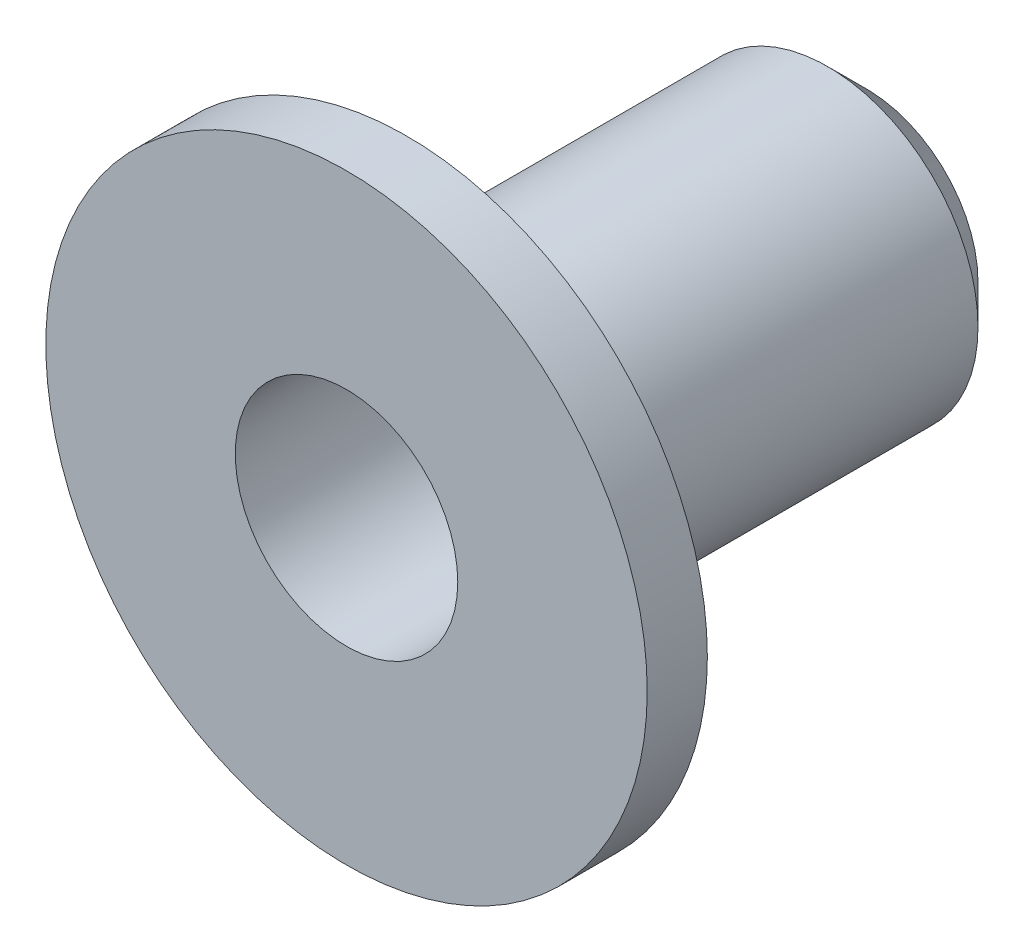
ISO-10303-21;
HEADER;
FILE_DESCRIPTION(('STEP AP214'),'2;1');
FILE_NAME('part.step','',(''),(''),'','','');
FILE_SCHEMA(('AUTOMOTIVE_DESIGN { 1 0 10303 214 1 1 1 1 }'));
ENDSEC;
DATA;
#1=APPLICATION_CONTEXT('core data for automotive mechanical design processes');
#2=APPLICATION_PROTOCOL_DEFINITION('international standard','automotive_design',2000,#1);
#3=PRODUCT_CONTEXT('',#1,'mechanical');
#4=PRODUCT('Part','Part','',(#3));
#5=PRODUCT_RELATED_PRODUCT_CATEGORY('part','',(#4));
#6=PRODUCT_DEFINITION_FORMATION('','',#4);
#7=PRODUCT_DEFINITION_CONTEXT('part definition',#1,'design');
#8=PRODUCT_DEFINITION('design','',#6,#7);
#9=PRODUCT_DEFINITION_SHAPE('','',#8);
#10=(LENGTH_UNIT() NAMED_UNIT(*) SI_UNIT(.MILLI.,.METRE.));
#11=(NAMED_UNIT(*) PLANE_ANGLE_UNIT() SI_UNIT($,.RADIAN.));
#12=(NAMED_UNIT(*) SI_UNIT($,.STERADIAN.) SOLID_ANGLE_UNIT());
#13=UNCERTAINTY_MEASURE_WITH_UNIT(LENGTH_MEASURE(1.E-05),#10,'distance_accuracy_value','');
#14=(GEOMETRIC_REPRESENTATION_CONTEXT(3) GLOBAL_UNCERTAINTY_ASSIGNED_CONTEXT((#13)) GLOBAL_UNIT_ASSIGNED_CONTEXT((#10,
#11,#12)) REPRESENTATION_CONTEXT('',''));
#15=CARTESIAN_POINT('',(0.,0.,0.));
#16=DIRECTION('',(0.,0.,1.));
#17=DIRECTION('',(1.,0.,0.));
#18=AXIS2_PLACEMENT_3D('',#15,#16,#17);
#19=CARTESIAN_POINT('',(0.,0.,3.));
#20=DIRECTION('',(0.,0.,-1.));
#21=DIRECTION('',(-1.,0.,0.));
#22=AXIS2_PLACEMENT_3D('',#19,#20,#21);
#23=CYLINDRICAL_SURFACE('',#22,15.);
#24=CARTESIAN_POINT('',(0.,0.,3.));
#25=DIRECTION('',(0.,0.,1.));
#26=DIRECTION('',(1.,0.,0.));
#27=AXIS2_PLACEMENT_3D('',#24,#25,#26);
#28=CIRCLE('',#27,15.);
#29=CARTESIAN_POINT('',(15.,0.,3.));
#30=VERTEX_POINT('',#29);
#31=EDGE_CURVE('E51',#30,#30,#28,.T.);
#32=ORIENTED_EDGE('',*,*,#31,.F.);
#33=EDGE_LOOP('',(#32));
#34=FACE_BOUND('',#33,.T.);
#35=CARTESIAN_POINT('',(0.,0.,0.));
#36=DIRECTION('',(0.,0.,1.));
#37=DIRECTION('',(1.,0.,0.));
#38=AXIS2_PLACEMENT_3D('',#35,#36,#37);
#39=CIRCLE('',#38,15.);
#40=CARTESIAN_POINT('',(15.,0.,0.));
#41=VERTEX_POINT('',#40);
#42=EDGE_CURVE('E54',#41,#41,#39,.T.);
#43=ORIENTED_EDGE('',*,*,#42,.T.);
#44=EDGE_LOOP('',(#43));
#45=FACE_BOUND('',#44,.T.);
#46=ADVANCED_FACE('F37',(#34,#45),#23,.T.);
#47=CARTESIAN_POINT('',(0.,0.,3.));
#48=DIRECTION('',(0.,0.,1.));
#49=DIRECTION('',(1.,0.,0.));
#50=AXIS2_PLACEMENT_3D('',#47,#48,#49);
#51=PLANE('',#50);
#52=CARTESIAN_POINT('',(0.,0.,3.));
#53=DIRECTION('',(0.,0.,1.));
#54=DIRECTION('',(1.,0.,0.));
#55=AXIS2_PLACEMENT_3D('',#52,#53,#54);
#56=CIRCLE('',#55,5.55);
#57=CARTESIAN_POINT('',(5.55,0.,3.));
#58=VERTEX_POINT('',#57);
#59=EDGE_CURVE('E61',#58,#58,#56,.T.);
#60=ORIENTED_EDGE('',*,*,#59,.F.);
#61=EDGE_LOOP('',(#60));
#62=FACE_BOUND('',#61,.T.);
#63=ORIENTED_EDGE('',*,*,#31,.T.);
#64=EDGE_LOOP('',(#63));
#65=FACE_BOUND('',#64,.T.);
#66=ADVANCED_FACE('F83',(#62,#65),#51,.T.);
#67=CARTESIAN_POINT('',(0.,0.,0.));
#68=DIRECTION('',(0.,0.,1.));
#69=DIRECTION('',(1.,0.,0.));
#70=AXIS2_PLACEMENT_3D('',#67,#68,#69);
#71=PLANE('',#70);
#72=CARTESIAN_POINT('',(0.,0.,0.));
#73=DIRECTION('',(0.,0.,-1.));
#74=DIRECTION('',(-1.,0.,0.));
#75=AXIS2_PLACEMENT_3D('',#72,#73,#74);
#76=CIRCLE('',#75,7.5);
#77=CARTESIAN_POINT('',(-7.5,0.,0.));
#78=VERTEX_POINT('',#77);
#79=EDGE_CURVE('E46',#78,#78,#76,.T.);
#80=ORIENTED_EDGE('',*,*,#79,.F.);
#81=EDGE_LOOP('',(#80));
#82=FACE_BOUND('',#81,.T.);
#83=ORIENTED_EDGE('',*,*,#42,.F.);
#84=EDGE_LOOP('',(#83));
#85=FACE_BOUND('',#84,.T.);
#86=ADVANCED_FACE('F80',(#82,#85),#71,.F.);
#87=CARTESIAN_POINT('',(0.,0.,-23.));
#88=DIRECTION('',(0.,0.,1.));
#89=DIRECTION('',(1.,0.,0.));
#90=AXIS2_PLACEMENT_3D('',#87,#88,#89);
#91=CYLINDRICAL_SURFACE('',#90,7.5);
#92=CARTESIAN_POINT('',(0.,0.,-21.));
#93=DIRECTION('',(0.,0.,-1.));
#94=DIRECTION('',(-1.,0.,0.));
#95=AXIS2_PLACEMENT_3D('',#92,#93,#94);
#96=CIRCLE('',#95,7.5);
#97=CARTESIAN_POINT('',(-7.5,0.,-21.));
#98=VERTEX_POINT('',#97);
#99=EDGE_CURVE('E10',#98,#98,#96,.F.);
#100=ORIENTED_EDGE('',*,*,#99,.T.);
#101=EDGE_LOOP('',(#100));
#102=FACE_BOUND('',#101,.T.);
#103=ORIENTED_EDGE('',*,*,#79,.T.);
#104=EDGE_LOOP('',(#103));
#105=FACE_BOUND('',#104,.T.);
#106=ADVANCED_FACE('F74',(#102,#105),#91,.T.);
#107=CARTESIAN_POINT('',(0.,0.,-23.));
#108=DIRECTION('',(0.,0.,1.));
#109=DIRECTION('',(1.,0.,0.));
#110=AXIS2_PLACEMENT_3D('',#107,#108,#109);
#111=CONICAL_SURFACE('',#110,5.49999999999999,0.785398163397447);
#112=CARTESIAN_POINT('',(0.,0.,-22.95));
#113=DIRECTION('',(0.,0.,1.));
#114=DIRECTION('',(1.,0.,0.));
#115=AXIS2_PLACEMENT_3D('',#112,#113,#114);
#116=CIRCLE('',#115,5.55);
#117=CARTESIAN_POINT('',(5.55,0.,-22.95));
#118=VERTEX_POINT('',#117);
#119=EDGE_CURVE('E41',#118,#118,#116,.F.);
#120=ORIENTED_EDGE('',*,*,#119,.F.);
#121=EDGE_LOOP('',(#120));
#122=FACE_BOUND('',#121,.T.);
#123=ORIENTED_EDGE('',*,*,#99,.F.);
#124=EDGE_LOOP('',(#123));
#125=FACE_BOUND('',#124,.T.);
#126=ADVANCED_FACE('F39',(#122,#125),#111,.T.);
#127=CARTESIAN_POINT('',(0.,0.,0.));
#128=DIRECTION('',(0.,0.,-1.));
#129=DIRECTION('',(-1.,0.,0.));
#130=AXIS2_PLACEMENT_3D('',#127,#128,#129);
#131=CYLINDRICAL_SURFACE('',#130,5.55);
#132=ORIENTED_EDGE('',*,*,#119,.T.);
#133=EDGE_LOOP('',(#132));
#134=FACE_BOUND('',#133,.T.);
#135=ORIENTED_EDGE('',*,*,#59,.T.);
#136=EDGE_LOOP('',(#135));
#137=FACE_BOUND('',#136,.T.);
#138=ADVANCED_FACE('F70',(#134,#137),#131,.F.);
#139=CLOSED_SHELL('',(#46,#66,#86,#106,#126,#138));
#140=MANIFOLD_SOLID_BREP('B2',#139);
#141=ADVANCED_BREP_SHAPE_REPRESENTATION('',(#18,#140),#14);
#142=SHAPE_DEFINITION_REPRESENTATION(#9,#141);
ENDSEC;
END-ISO-10303-21;
